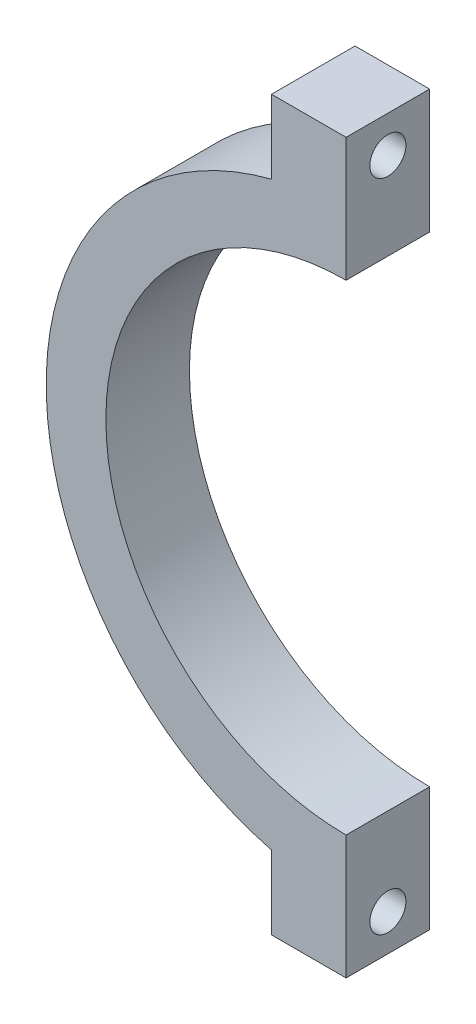
ISO-10303-21;
HEADER;
FILE_DESCRIPTION(('STEP AP214'),'2;1');
FILE_NAME('part.step','',(''),(''),'','','');
FILE_SCHEMA(('AUTOMOTIVE_DESIGN { 1 0 10303 214 1 1 1 1 }'));
ENDSEC;
DATA;
#1=APPLICATION_CONTEXT('core data for automotive mechanical design processes');
#2=APPLICATION_PROTOCOL_DEFINITION('international standard','automotive_design',2000,#1);
#3=PRODUCT_CONTEXT('',#1,'mechanical');
#4=PRODUCT('Part','Part','',(#3));
#5=PRODUCT_RELATED_PRODUCT_CATEGORY('part','',(#4));
#6=PRODUCT_DEFINITION_FORMATION('','',#4);
#7=PRODUCT_DEFINITION_CONTEXT('part definition',#1,'design');
#8=PRODUCT_DEFINITION('design','',#6,#7);
#9=PRODUCT_DEFINITION_SHAPE('','',#8);
#10=(LENGTH_UNIT() NAMED_UNIT(*) SI_UNIT(.MILLI.,.METRE.));
#11=(NAMED_UNIT(*) PLANE_ANGLE_UNIT() SI_UNIT($,.RADIAN.));
#12=(NAMED_UNIT(*) SI_UNIT($,.STERADIAN.) SOLID_ANGLE_UNIT());
#13=UNCERTAINTY_MEASURE_WITH_UNIT(LENGTH_MEASURE(1.E-05),#10,'distance_accuracy_value','');
#14=(GEOMETRIC_REPRESENTATION_CONTEXT(3) GLOBAL_UNCERTAINTY_ASSIGNED_CONTEXT((#13)) GLOBAL_UNIT_ASSIGNED_CONTEXT((#10,
#11,#12)) REPRESENTATION_CONTEXT('',''));
#15=CARTESIAN_POINT('',(0.,0.,0.));
#16=DIRECTION('',(0.,0.,1.));
#17=DIRECTION('',(1.,0.,0.));
#18=AXIS2_PLACEMENT_3D('',#15,#16,#17);
#19=CARTESIAN_POINT('',(0.,0.,28.));
#20=DIRECTION('',(0.,0.,-1.));
#21=DIRECTION('',(-1.,0.,0.));
#22=AXIS2_PLACEMENT_3D('',#19,#20,#21);
#23=CYLINDRICAL_SURFACE('',#22,80.5);
#24=CARTESIAN_POINT('',(0.,0.,0.));
#25=DIRECTION('',(0.,0.,-1.));
#26=DIRECTION('',(1.,0.,0.));
#27=AXIS2_PLACEMENT_3D('',#24,#25,#26);
#28=CIRCLE('',#27,80.5);
#29=CARTESIAN_POINT('',(0.,-80.5,0.));
#30=VERTEX_POINT('',#29);
#31=CARTESIAN_POINT('',(0.,80.5,0.));
#32=VERTEX_POINT('',#31);
#33=EDGE_CURVE('E141',#30,#32,#28,.T.);
#34=ORIENTED_EDGE('',*,*,#33,.T.);
#35=DIRECTION('',(0.,0.,-1.));
#36=VECTOR('',#35,1.);
#37=CARTESIAN_POINT('',(0.,80.5,28.));
#38=LINE('',#37,#36);
#39=CARTESIAN_POINT('',(0.,80.5,28.));
#40=VERTEX_POINT('',#39);
#41=EDGE_CURVE('E11',#40,#32,#38,.T.);
#42=ORIENTED_EDGE('',*,*,#41,.F.);
#43=CARTESIAN_POINT('',(0.,0.,28.));
#44=DIRECTION('',(0.,0.,-1.));
#45=DIRECTION('',(1.,0.,0.));
#46=AXIS2_PLACEMENT_3D('',#43,#44,#45);
#47=CIRCLE('',#46,80.5);
#48=CARTESIAN_POINT('',(0.,-80.5,28.));
#49=VERTEX_POINT('',#48);
#50=EDGE_CURVE('E163',#49,#40,#47,.T.);
#51=ORIENTED_EDGE('',*,*,#50,.F.);
#52=DIRECTION('',(0.,0.,-1.));
#53=VECTOR('',#52,1.);
#54=CARTESIAN_POINT('',(0.,-80.5,28.));
#55=LINE('',#54,#53);
#56=EDGE_CURVE('E137',#49,#30,#55,.T.);
#57=ORIENTED_EDGE('',*,*,#56,.T.);
#58=EDGE_LOOP('',(#34,#42,#51,#57));
#59=FACE_BOUND('',#58,.T.);
#60=ADVANCED_FACE('F39',(#59),#23,.F.);
#61=CARTESIAN_POINT('',(0.,80.5,28.));
#62=DIRECTION('',(-1.,0.,0.));
#63=DIRECTION('',(0.,0.,1.));
#64=AXIS2_PLACEMENT_3D('',#61,#62,#63);
#65=PLANE('',#64);
#66=CARTESIAN_POINT('',(0.,109.75,14.));
#67=DIRECTION('',(1.,0.,0.));
#68=DIRECTION('',(0.,0.,-1.));
#69=AXIS2_PLACEMENT_3D('',#66,#67,#68);
#70=CIRCLE('',#69,6.05);
#71=CARTESIAN_POINT('',(0.,109.75,7.95));
#72=VERTEX_POINT('',#71);
#73=EDGE_CURVE('E212',#72,#72,#70,.T.);
#74=ORIENTED_EDGE('',*,*,#73,.F.);
#75=EDGE_LOOP('',(#74));
#76=FACE_BOUND('',#75,.T.);
#77=DIRECTION('',(0.,1.,0.));
#78=VECTOR('',#77,1.);
#79=CARTESIAN_POINT('',(0.,80.5,0.));
#80=LINE('',#79,#78);
#81=CARTESIAN_POINT('',(0.,122.,0.));
#82=VERTEX_POINT('',#81);
#83=EDGE_CURVE('E145',#32,#82,#80,.T.);
#84=ORIENTED_EDGE('',*,*,#83,.T.);
#85=DIRECTION('',(0.,0.,-1.));
#86=VECTOR('',#85,1.);
#87=CARTESIAN_POINT('',(0.,122.,28.));
#88=LINE('',#87,#86);
#89=CARTESIAN_POINT('',(0.,122.,28.));
#90=VERTEX_POINT('',#89);
#91=EDGE_CURVE('E49',#90,#82,#88,.T.);
#92=ORIENTED_EDGE('',*,*,#91,.F.);
#93=DIRECTION('',(0.,1.,0.));
#94=VECTOR('',#93,1.);
#95=CARTESIAN_POINT('',(0.,80.5,28.));
#96=LINE('',#95,#94);
#97=EDGE_CURVE('E100',#40,#90,#96,.T.);
#98=ORIENTED_EDGE('',*,*,#97,.F.);
#99=ORIENTED_EDGE('',*,*,#41,.T.);
#100=EDGE_LOOP('',(#84,#92,#98,#99));
#101=FACE_BOUND('',#100,.T.);
#102=ADVANCED_FACE('F224',(#76,#101),#65,.F.);
#103=CARTESIAN_POINT('',(0.,122.,28.));
#104=DIRECTION('',(0.,-1.,0.));
#105=DIRECTION('',(1.,0.,0.));
#106=AXIS2_PLACEMENT_3D('',#103,#104,#105);
#107=PLANE('',#106);
#108=DIRECTION('',(-1.,0.,0.));
#109=VECTOR('',#108,1.);
#110=CARTESIAN_POINT('',(0.,122.,0.));
#111=LINE('',#110,#109);
#112=CARTESIAN_POINT('',(-25.,122.,0.));
#113=VERTEX_POINT('',#112);
#114=EDGE_CURVE('E148',#82,#113,#111,.T.);
#115=ORIENTED_EDGE('',*,*,#114,.T.);
#116=DIRECTION('',(0.,0.,-1.));
#117=VECTOR('',#116,1.);
#118=CARTESIAN_POINT('',(-25.,122.,28.));
#119=LINE('',#118,#117);
#120=CARTESIAN_POINT('',(-25.,122.,28.));
#121=VERTEX_POINT('',#120);
#122=EDGE_CURVE('E174',#121,#113,#119,.T.);
#123=ORIENTED_EDGE('',*,*,#122,.F.);
#124=DIRECTION('',(-1.,0.,0.));
#125=VECTOR('',#124,1.);
#126=CARTESIAN_POINT('',(0.,122.,28.));
#127=LINE('',#126,#125);
#128=EDGE_CURVE('E185',#90,#121,#127,.T.);
#129=ORIENTED_EDGE('',*,*,#128,.F.);
#130=ORIENTED_EDGE('',*,*,#91,.T.);
#131=EDGE_LOOP('',(#115,#123,#129,#130));
#132=FACE_BOUND('',#131,.T.);
#133=ADVANCED_FACE('F183',(#132),#107,.F.);
#134=CARTESIAN_POINT('',(-25.,122.,28.));
#135=DIRECTION('',(1.,0.,0.));
#136=DIRECTION('',(0.,0.,-1.));
#137=AXIS2_PLACEMENT_3D('',#134,#135,#136);
#138=PLANE('',#137);
#139=CARTESIAN_POINT('',(-25.,109.75,14.));
#140=DIRECTION('',(1.,0.,0.));
#141=DIRECTION('',(0.,0.,-1.));
#142=AXIS2_PLACEMENT_3D('',#139,#140,#141);
#143=CIRCLE('',#142,6.05);
#144=CARTESIAN_POINT('',(-25.,109.75,7.95));
#145=VERTEX_POINT('',#144);
#146=EDGE_CURVE('E42',#145,#145,#143,.T.);
#147=ORIENTED_EDGE('',*,*,#146,.T.);
#148=EDGE_LOOP('',(#147));
#149=FACE_BOUND('',#148,.T.);
#150=DIRECTION('',(0.,-1.,0.));
#151=VECTOR('',#150,1.);
#152=CARTESIAN_POINT('',(-25.,122.,0.));
#153=LINE('',#152,#151);
#154=CARTESIAN_POINT('',(-25.,97.3408958249307,0.));
#155=VERTEX_POINT('',#154);
#156=EDGE_CURVE('E151',#113,#155,#153,.T.);
#157=ORIENTED_EDGE('',*,*,#156,.T.);
#158=DIRECTION('',(0.,0.,-1.));
#159=VECTOR('',#158,1.);
#160=CARTESIAN_POINT('',(-25.,97.3408958249307,28.));
#161=LINE('',#160,#159);
#162=CARTESIAN_POINT('',(-25.,97.3408958249307,28.));
#163=VERTEX_POINT('',#162);
#164=EDGE_CURVE('E170',#163,#155,#161,.T.);
#165=ORIENTED_EDGE('',*,*,#164,.F.);
#166=DIRECTION('',(0.,-1.,0.));
#167=VECTOR('',#166,1.);
#168=CARTESIAN_POINT('',(-25.,122.,28.));
#169=LINE('',#168,#167);
#170=EDGE_CURVE('E198',#121,#163,#169,.T.);
#171=ORIENTED_EDGE('',*,*,#170,.F.);
#172=ORIENTED_EDGE('',*,*,#122,.T.);
#173=EDGE_LOOP('',(#157,#165,#171,#172));
#174=FACE_BOUND('',#173,.T.);
#175=ADVANCED_FACE('F193',(#149,#174),#138,.F.);
#176=CARTESIAN_POINT('',(0.,0.,28.));
#177=DIRECTION('',(0.,0.,-1.));
#178=DIRECTION('',(-1.,0.,0.));
#179=AXIS2_PLACEMENT_3D('',#176,#177,#178);
#180=CYLINDRICAL_SURFACE('',#179,100.5);
#181=CARTESIAN_POINT('',(0.,0.,0.));
#182=DIRECTION('',(0.,0.,1.));
#183=DIRECTION('',(1.,0.,0.));
#184=AXIS2_PLACEMENT_3D('',#181,#182,#183);
#185=CIRCLE('',#184,100.5);
#186=CARTESIAN_POINT('',(-25.,-97.3408958249306,0.));
#187=VERTEX_POINT('',#186);
#188=EDGE_CURVE('E154',#155,#187,#185,.T.);
#189=ORIENTED_EDGE('',*,*,#188,.T.);
#190=DIRECTION('',(0.,0.,-1.));
#191=VECTOR('',#190,1.);
#192=CARTESIAN_POINT('',(-25.,-97.3408958249306,28.));
#193=LINE('',#192,#191);
#194=CARTESIAN_POINT('',(-25.,-97.3408958249306,28.));
#195=VERTEX_POINT('',#194);
#196=EDGE_CURVE('E130',#195,#187,#193,.T.);
#197=ORIENTED_EDGE('',*,*,#196,.F.);
#198=CARTESIAN_POINT('',(0.,0.,28.));
#199=DIRECTION('',(0.,0.,1.));
#200=DIRECTION('',(1.,0.,0.));
#201=AXIS2_PLACEMENT_3D('',#198,#199,#200);
#202=CIRCLE('',#201,100.5);
#203=EDGE_CURVE('E119',#163,#195,#202,.T.);
#204=ORIENTED_EDGE('',*,*,#203,.F.);
#205=ORIENTED_EDGE('',*,*,#164,.T.);
#206=EDGE_LOOP('',(#189,#197,#204,#205));
#207=FACE_BOUND('',#206,.T.);
#208=ADVANCED_FACE('F196',(#207),#180,.T.);
#209=CARTESIAN_POINT('',(-25.,-122.,28.));
#210=DIRECTION('',(1.,0.,0.));
#211=DIRECTION('',(0.,0.,-1.));
#212=AXIS2_PLACEMENT_3D('',#209,#210,#211);
#213=PLANE('',#212);
#214=CARTESIAN_POINT('',(-25.,-109.75,14.));
#215=DIRECTION('',(1.,0.,0.));
#216=DIRECTION('',(0.,0.,-1.));
#217=AXIS2_PLACEMENT_3D('',#214,#215,#216);
#218=CIRCLE('',#217,6.05);
#219=CARTESIAN_POINT('',(-25.,-109.75,7.95));
#220=VERTEX_POINT('',#219);
#221=EDGE_CURVE('E208',#220,#220,#218,.T.);
#222=ORIENTED_EDGE('',*,*,#221,.T.);
#223=EDGE_LOOP('',(#222));
#224=FACE_BOUND('',#223,.T.);
#225=DIRECTION('',(0.,-1.,0.));
#226=VECTOR('',#225,1.);
#227=CARTESIAN_POINT('',(-25.,-122.,0.));
#228=LINE('',#227,#226);
#229=CARTESIAN_POINT('',(-25.,-122.,0.));
#230=VERTEX_POINT('',#229);
#231=EDGE_CURVE('E128',#187,#230,#228,.T.);
#232=ORIENTED_EDGE('',*,*,#231,.T.);
#233=DIRECTION('',(0.,0.,-1.));
#234=VECTOR('',#233,1.);
#235=CARTESIAN_POINT('',(-25.,-122.,28.));
#236=LINE('',#235,#234);
#237=CARTESIAN_POINT('',(-25.,-122.,28.));
#238=VERTEX_POINT('',#237);
#239=EDGE_CURVE('E125',#238,#230,#236,.T.);
#240=ORIENTED_EDGE('',*,*,#239,.F.);
#241=DIRECTION('',(0.,-1.,0.));
#242=VECTOR('',#241,1.);
#243=CARTESIAN_POINT('',(-25.,-122.,28.));
#244=LINE('',#243,#242);
#245=EDGE_CURVE('E113',#195,#238,#244,.T.);
#246=ORIENTED_EDGE('',*,*,#245,.F.);
#247=ORIENTED_EDGE('',*,*,#196,.T.);
#248=EDGE_LOOP('',(#232,#240,#246,#247));
#249=FACE_BOUND('',#248,.T.);
#250=ADVANCED_FACE('F126',(#224,#249),#213,.F.);
#251=CARTESIAN_POINT('',(0.,-122.,28.));
#252=DIRECTION('',(0.,1.,0.));
#253=DIRECTION('',(0.,0.,1.));
#254=AXIS2_PLACEMENT_3D('',#251,#252,#253);
#255=PLANE('',#254);
#256=DIRECTION('',(1.,0.,0.));
#257=VECTOR('',#256,1.);
#258=CARTESIAN_POINT('',(0.,-122.,0.));
#259=LINE('',#258,#257);
#260=CARTESIAN_POINT('',(0.,-122.,0.));
#261=VERTEX_POINT('',#260);
#262=EDGE_CURVE('E86',#230,#261,#259,.T.);
#263=ORIENTED_EDGE('',*,*,#262,.T.);
#264=DIRECTION('',(0.,0.,-1.));
#265=VECTOR('',#264,1.);
#266=CARTESIAN_POINT('',(0.,-122.,28.));
#267=LINE('',#266,#265);
#268=CARTESIAN_POINT('',(0.,-122.,28.));
#269=VERTEX_POINT('',#268);
#270=EDGE_CURVE('E131',#269,#261,#267,.T.);
#271=ORIENTED_EDGE('',*,*,#270,.F.);
#272=DIRECTION('',(1.,0.,0.));
#273=VECTOR('',#272,1.);
#274=CARTESIAN_POINT('',(0.,-122.,28.));
#275=LINE('',#274,#273);
#276=EDGE_CURVE('E117',#238,#269,#275,.T.);
#277=ORIENTED_EDGE('',*,*,#276,.F.);
#278=ORIENTED_EDGE('',*,*,#239,.T.);
#279=EDGE_LOOP('',(#263,#271,#277,#278));
#280=FACE_BOUND('',#279,.T.);
#281=ADVANCED_FACE('F133',(#280),#255,.F.);
#282=CARTESIAN_POINT('',(0.,-80.5,28.));
#283=DIRECTION('',(-1.,0.,0.));
#284=DIRECTION('',(0.,-1.,0.));
#285=AXIS2_PLACEMENT_3D('',#282,#283,#284);
#286=PLANE('',#285);
#287=CARTESIAN_POINT('',(0.,-109.75,14.));
#288=DIRECTION('',(1.,0.,0.));
#289=DIRECTION('',(0.,0.,-1.));
#290=AXIS2_PLACEMENT_3D('',#287,#288,#289);
#291=CIRCLE('',#290,6.05);
#292=CARTESIAN_POINT('',(0.,-109.75,7.95));
#293=VERTEX_POINT('',#292);
#294=EDGE_CURVE('E213',#293,#293,#291,.T.);
#295=ORIENTED_EDGE('',*,*,#294,.F.);
#296=EDGE_LOOP('',(#295));
#297=FACE_BOUND('',#296,.T.);
#298=DIRECTION('',(0.,1.,0.));
#299=VECTOR('',#298,1.);
#300=CARTESIAN_POINT('',(0.,-80.5,0.));
#301=LINE('',#300,#299);
#302=EDGE_CURVE('E92',#261,#30,#301,.T.);
#303=ORIENTED_EDGE('',*,*,#302,.T.);
#304=ORIENTED_EDGE('',*,*,#56,.F.);
#305=DIRECTION('',(0.,1.,0.));
#306=VECTOR('',#305,1.);
#307=CARTESIAN_POINT('',(0.,-80.5,28.));
#308=LINE('',#307,#306);
#309=EDGE_CURVE('E57',#269,#49,#308,.T.);
#310=ORIENTED_EDGE('',*,*,#309,.F.);
#311=ORIENTED_EDGE('',*,*,#270,.T.);
#312=EDGE_LOOP('',(#303,#304,#310,#311));
#313=FACE_BOUND('',#312,.T.);
#314=ADVANCED_FACE('F229',(#297,#313),#286,.F.);
#315=CARTESIAN_POINT('',(0.,0.,28.));
#316=DIRECTION('',(0.,0.,1.));
#317=DIRECTION('',(1.,0.,0.));
#318=AXIS2_PLACEMENT_3D('',#315,#316,#317);
#319=PLANE('',#318);
#320=ORIENTED_EDGE('',*,*,#50,.T.);
#321=ORIENTED_EDGE('',*,*,#97,.T.);
#322=ORIENTED_EDGE('',*,*,#128,.T.);
#323=ORIENTED_EDGE('',*,*,#170,.T.);
#324=ORIENTED_EDGE('',*,*,#203,.T.);
#325=ORIENTED_EDGE('',*,*,#245,.T.);
#326=ORIENTED_EDGE('',*,*,#276,.T.);
#327=ORIENTED_EDGE('',*,*,#309,.T.);
#328=EDGE_LOOP('',(#320,#321,#322,#323,#324,#325,#326,#327));
#329=FACE_BOUND('',#328,.T.);
#330=ADVANCED_FACE('F115',(#329),#319,.T.);
#331=CARTESIAN_POINT('',(0.,0.,0.));
#332=DIRECTION('',(0.,0.,1.));
#333=DIRECTION('',(1.,0.,0.));
#334=AXIS2_PLACEMENT_3D('',#331,#332,#333);
#335=PLANE('',#334);
#336=ORIENTED_EDGE('',*,*,#33,.F.);
#337=ORIENTED_EDGE('',*,*,#302,.F.);
#338=ORIENTED_EDGE('',*,*,#262,.F.);
#339=ORIENTED_EDGE('',*,*,#231,.F.);
#340=ORIENTED_EDGE('',*,*,#188,.F.);
#341=ORIENTED_EDGE('',*,*,#156,.F.);
#342=ORIENTED_EDGE('',*,*,#114,.F.);
#343=ORIENTED_EDGE('',*,*,#83,.F.);
#344=EDGE_LOOP('',(#336,#337,#338,#339,#340,#341,#342,#343));
#345=FACE_BOUND('',#344,.T.);
#346=ADVANCED_FACE('F189',(#345),#335,.F.);
#347=CARTESIAN_POINT('',(-28.,-109.75,14.));
#348=DIRECTION('',(1.,0.,0.));
#349=DIRECTION('',(0.,0.,-1.));
#350=AXIS2_PLACEMENT_3D('',#347,#348,#349);
#351=CYLINDRICAL_SURFACE('',#350,6.05);
#352=ORIENTED_EDGE('',*,*,#294,.T.);
#353=EDGE_LOOP('',(#352));
#354=FACE_BOUND('',#353,.T.);
#355=ORIENTED_EDGE('',*,*,#221,.F.);
#356=EDGE_LOOP('',(#355));
#357=FACE_BOUND('',#356,.T.);
#358=ADVANCED_FACE('F293',(#354,#357),#351,.F.);
#359=CARTESIAN_POINT('',(-28.,109.75,14.));
#360=DIRECTION('',(1.,0.,0.));
#361=DIRECTION('',(0.,0.,-1.));
#362=AXIS2_PLACEMENT_3D('',#359,#360,#361);
#363=CYLINDRICAL_SURFACE('',#362,6.05);
#364=ORIENTED_EDGE('',*,*,#73,.T.);
#365=EDGE_LOOP('',(#364));
#366=FACE_BOUND('',#365,.T.);
#367=ORIENTED_EDGE('',*,*,#146,.F.);
#368=EDGE_LOOP('',(#367));
#369=FACE_BOUND('',#368,.T.);
#370=ADVANCED_FACE('F221',(#366,#369),#363,.F.);
#371=CLOSED_SHELL('',(#60,#102,#133,#175,#208,#250,#281,#314,#330,#346,#358,#370));
#372=MANIFOLD_SOLID_BREP('B2',#371);
#373=ADVANCED_BREP_SHAPE_REPRESENTATION('',(#18,#372),#14);
#374=SHAPE_DEFINITION_REPRESENTATION(#9,#373);
ENDSEC;
END-ISO-10303-21;
